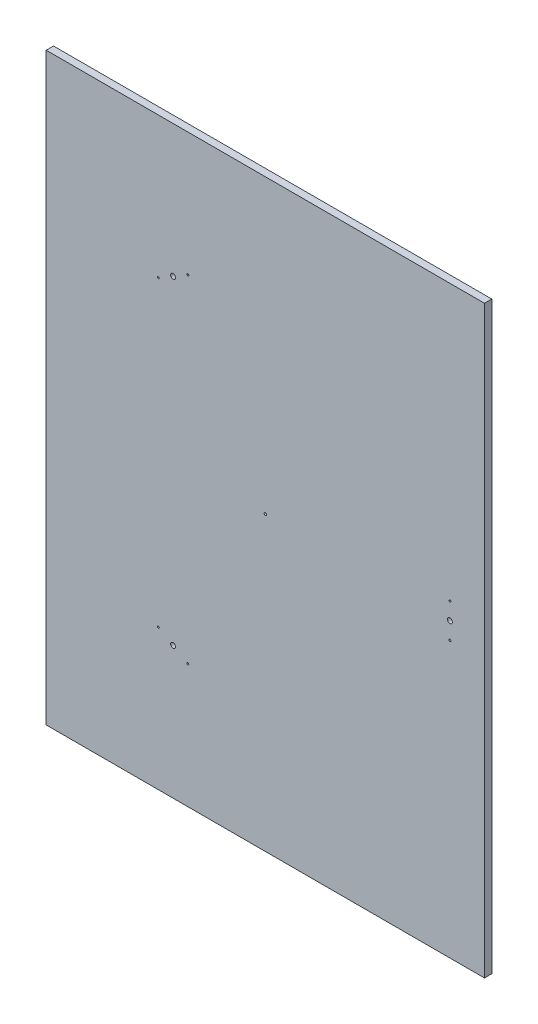
ISO-10303-21;
HEADER;
FILE_DESCRIPTION(('STEP AP214'),'2;1');
FILE_NAME('part.step','',(''),(''),'','','');
FILE_SCHEMA(('AUTOMOTIVE_DESIGN { 1 0 10303 214 1 1 1 1 }'));
ENDSEC;
DATA;
#1=APPLICATION_CONTEXT('core data for automotive mechanical design processes');
#2=APPLICATION_PROTOCOL_DEFINITION('international standard','automotive_design',2000,#1);
#3=PRODUCT_CONTEXT('',#1,'mechanical');
#4=PRODUCT('Part','Part','',(#3));
#5=PRODUCT_RELATED_PRODUCT_CATEGORY('part','',(#4));
#6=PRODUCT_DEFINITION_FORMATION('','',#4);
#7=PRODUCT_DEFINITION_CONTEXT('part definition',#1,'design');
#8=PRODUCT_DEFINITION('design','',#6,#7);
#9=PRODUCT_DEFINITION_SHAPE('','',#8);
#10=(LENGTH_UNIT() NAMED_UNIT(*) SI_UNIT(.MILLI.,.METRE.));
#11=(NAMED_UNIT(*) PLANE_ANGLE_UNIT() SI_UNIT($,.RADIAN.));
#12=(NAMED_UNIT(*) SI_UNIT($,.STERADIAN.) SOLID_ANGLE_UNIT());
#13=UNCERTAINTY_MEASURE_WITH_UNIT(LENGTH_MEASURE(1.E-05),#10,'distance_accuracy_value','');
#14=(GEOMETRIC_REPRESENTATION_CONTEXT(3) GLOBAL_UNCERTAINTY_ASSIGNED_CONTEXT((#13)) GLOBAL_UNIT_ASSIGNED_CONTEXT((#10,
#11,#12)) REPRESENTATION_CONTEXT('',''));
#15=CARTESIAN_POINT('',(0.,0.,0.));
#16=DIRECTION('',(0.,0.,1.));
#17=DIRECTION('',(1.,0.,0.));
#18=AXIS2_PLACEMENT_3D('',#15,#16,#17);
#19=CARTESIAN_POINT('',(0.,0.,15.));
#20=DIRECTION('',(0.,0.,-1.));
#21=DIRECTION('',(-1.,0.,0.));
#22=AXIS2_PLACEMENT_3D('',#19,#20,#21);
#23=PLANE('',#22);
#24=DIRECTION('',(0.,1.,0.));
#25=VECTOR('',#24,1.);
#26=CARTESIAN_POINT('',(450.,-600.,15.));
#27=LINE('',#26,#25);
#28=CARTESIAN_POINT('',(450.,-600.,15.));
#29=VERTEX_POINT('',#28);
#30=CARTESIAN_POINT('',(450.,600.,15.));
#31=VERTEX_POINT('',#30);
#32=EDGE_CURVE('E85',#29,#31,#27,.T.);
#33=ORIENTED_EDGE('',*,*,#32,.T.);
#34=DIRECTION('',(-1.,0.,0.));
#35=VECTOR('',#34,1.);
#36=CARTESIAN_POINT('',(-450.,600.,15.));
#37=LINE('',#36,#35);
#38=CARTESIAN_POINT('',(-450.,600.,15.));
#39=VERTEX_POINT('',#38);
#40=EDGE_CURVE('E80',#31,#39,#37,.T.);
#41=ORIENTED_EDGE('',*,*,#40,.T.);
#42=DIRECTION('',(0.,-1.,0.));
#43=VECTOR('',#42,1.);
#44=CARTESIAN_POINT('',(-450.,-600.,15.));
#45=LINE('',#44,#43);
#46=CARTESIAN_POINT('',(-450.,-600.,15.));
#47=VERTEX_POINT('',#46);
#48=EDGE_CURVE('E83',#39,#47,#45,.T.);
#49=ORIENTED_EDGE('',*,*,#48,.T.);
#50=DIRECTION('',(1.,0.,0.));
#51=VECTOR('',#50,1.);
#52=CARTESIAN_POINT('',(-450.,-600.,15.));
#53=LINE('',#52,#51);
#54=EDGE_CURVE('E50',#47,#29,#53,.T.);
#55=ORIENTED_EDGE('',*,*,#54,.T.);
#56=EDGE_LOOP('',(#33,#41,#49,#55));
#57=FACE_BOUND('',#56,.T.);
#58=CARTESIAN_POINT('',(379.,0.,15.));
#59=DIRECTION('',(0.,0.,1.));
#60=DIRECTION('',(1.,0.,0.));
#61=AXIS2_PLACEMENT_3D('',#58,#59,#60);
#62=CIRCLE('',#61,4.99999999999999);
#63=CARTESIAN_POINT('',(384.,0.,15.));
#64=VERTEX_POINT('',#63);
#65=EDGE_CURVE('E100',#64,#64,#62,.T.);
#66=ORIENTED_EDGE('',*,*,#65,.F.);
#67=EDGE_LOOP('',(#66));
#68=FACE_BOUND('',#67,.T.);
#69=CARTESIAN_POINT('',(379.,35.,15.));
#70=DIRECTION('',(0.,0.,1.));
#71=DIRECTION('',(1.,0.,0.));
#72=AXIS2_PLACEMENT_3D('',#69,#70,#71);
#73=CIRCLE('',#72,2.);
#74=CARTESIAN_POINT('',(381.,35.,15.));
#75=VERTEX_POINT('',#74);
#76=EDGE_CURVE('E115',#75,#75,#73,.T.);
#77=ORIENTED_EDGE('',*,*,#76,.F.);
#78=EDGE_LOOP('',(#77));
#79=FACE_BOUND('',#78,.T.);
#80=CARTESIAN_POINT('',(379.,-35.,15.));
#81=DIRECTION('',(0.,0.,1.));
#82=DIRECTION('',(1.,0.,0.));
#83=AXIS2_PLACEMENT_3D('',#80,#81,#82);
#84=CIRCLE('',#83,2.);
#85=CARTESIAN_POINT('',(381.,-35.,15.));
#86=VERTEX_POINT('',#85);
#87=EDGE_CURVE('E121',#86,#86,#84,.T.);
#88=ORIENTED_EDGE('',*,*,#87,.F.);
#89=EDGE_LOOP('',(#88));
#90=FACE_BOUND('',#89,.T.);
#91=CARTESIAN_POINT('',(0.,0.,15.));
#92=DIRECTION('',(0.,0.,1.));
#93=DIRECTION('',(1.,0.,0.));
#94=AXIS2_PLACEMENT_3D('',#91,#92,#93);
#95=CIRCLE('',#94,2.5);
#96=CARTESIAN_POINT('',(2.5,0.,15.));
#97=VERTEX_POINT('',#96);
#98=EDGE_CURVE('E127',#97,#97,#95,.T.);
#99=ORIENTED_EDGE('',*,*,#98,.F.);
#100=EDGE_LOOP('',(#99));
#101=FACE_BOUND('',#100,.T.);
#102=CARTESIAN_POINT('',(-189.500000000002,-328.223628034301,15.));
#103=DIRECTION('',(0.,0.,1.));
#104=DIRECTION('',(1.,0.,0.));
#105=AXIS2_PLACEMENT_3D('',#102,#103,#104);
#106=CIRCLE('',#105,5.);
#107=CARTESIAN_POINT('',(-184.500000000002,-328.223628034301,15.));
#108=VERTEX_POINT('',#107);
#109=EDGE_CURVE('E133',#108,#108,#106,.T.);
#110=ORIENTED_EDGE('',*,*,#109,.F.);
#111=EDGE_LOOP('',(#110));
#112=FACE_BOUND('',#111,.T.);
#113=CARTESIAN_POINT('',(-159.189110867546,-345.723628034302,15.));
#114=DIRECTION('',(0.,0.,1.));
#115=DIRECTION('',(1.,0.,0.));
#116=AXIS2_PLACEMENT_3D('',#113,#114,#115);
#117=CIRCLE('',#116,2.);
#118=CARTESIAN_POINT('',(-157.189110867546,-345.723628034302,15.));
#119=VERTEX_POINT('',#118);
#120=EDGE_CURVE('E139',#119,#119,#117,.T.);
#121=ORIENTED_EDGE('',*,*,#120,.F.);
#122=EDGE_LOOP('',(#121));
#123=FACE_BOUND('',#122,.T.);
#124=CARTESIAN_POINT('',(-219.810889132457,-310.723628034301,15.));
#125=DIRECTION('',(0.,0.,1.));
#126=DIRECTION('',(1.,0.,0.));
#127=AXIS2_PLACEMENT_3D('',#124,#125,#126);
#128=CIRCLE('',#127,2.);
#129=CARTESIAN_POINT('',(-217.810889132457,-310.723628034301,15.));
#130=VERTEX_POINT('',#129);
#131=EDGE_CURVE('E145',#130,#130,#128,.T.);
#132=ORIENTED_EDGE('',*,*,#131,.F.);
#133=EDGE_LOOP('',(#132));
#134=FACE_BOUND('',#133,.T.);
#135=CARTESIAN_POINT('',(-189.499999999997,328.223628034304,15.));
#136=DIRECTION('',(0.,0.,1.));
#137=DIRECTION('',(1.,0.,0.));
#138=AXIS2_PLACEMENT_3D('',#135,#136,#137);
#139=CIRCLE('',#138,4.99999999999997);
#140=CARTESIAN_POINT('',(-184.499999999997,328.223628034304,15.));
#141=VERTEX_POINT('',#140);
#142=EDGE_CURVE('E151',#141,#141,#139,.T.);
#143=ORIENTED_EDGE('',*,*,#142,.F.);
#144=EDGE_LOOP('',(#143));
#145=FACE_BOUND('',#144,.T.);
#146=CARTESIAN_POINT('',(-219.810889132452,310.723628034304,15.));
#147=DIRECTION('',(0.,0.,1.));
#148=DIRECTION('',(1.,0.,0.));
#149=AXIS2_PLACEMENT_3D('',#146,#147,#148);
#150=CIRCLE('',#149,2.);
#151=CARTESIAN_POINT('',(-217.810889132452,310.723628034304,15.));
#152=VERTEX_POINT('',#151);
#153=EDGE_CURVE('E157',#152,#152,#150,.T.);
#154=ORIENTED_EDGE('',*,*,#153,.F.);
#155=EDGE_LOOP('',(#154));
#156=FACE_BOUND('',#155,.T.);
#157=CARTESIAN_POINT('',(-159.189110867541,345.723628034304,15.));
#158=DIRECTION('',(0.,0.,1.));
#159=DIRECTION('',(1.,0.,0.));
#160=AXIS2_PLACEMENT_3D('',#157,#158,#159);
#161=CIRCLE('',#160,2.00000000000002);
#162=CARTESIAN_POINT('',(-157.189110867541,345.723628034304,15.));
#163=VERTEX_POINT('',#162);
#164=EDGE_CURVE('E163',#163,#163,#161,.T.);
#165=ORIENTED_EDGE('',*,*,#164,.F.);
#166=EDGE_LOOP('',(#165));
#167=FACE_BOUND('',#166,.T.);
#168=ADVANCED_FACE('F33',(#57,#68,#79,#90,#101,#112,#123,#134,#145,#156,#167),#23,.F.);
#169=CARTESIAN_POINT('',(0.,0.,0.));
#170=DIRECTION('',(0.,0.,-1.));
#171=DIRECTION('',(-1.,0.,0.));
#172=AXIS2_PLACEMENT_3D('',#169,#170,#171);
#173=PLANE('',#172);
#174=CARTESIAN_POINT('',(-219.810889132452,310.723628034304,0.));
#175=DIRECTION('',(0.,0.,1.));
#176=DIRECTION('',(1.,0.,0.));
#177=AXIS2_PLACEMENT_3D('',#174,#175,#176);
#178=CIRCLE('',#177,2.);
#179=CARTESIAN_POINT('',(-217.810889132452,310.723628034304,0.));
#180=VERTEX_POINT('',#179);
#181=EDGE_CURVE('E160',#180,#180,#178,.T.);
#182=ORIENTED_EDGE('',*,*,#181,.T.);
#183=EDGE_LOOP('',(#182));
#184=FACE_BOUND('',#183,.T.);
#185=CARTESIAN_POINT('',(-219.810889132457,-310.723628034301,0.));
#186=DIRECTION('',(0.,0.,1.));
#187=DIRECTION('',(1.,0.,0.));
#188=AXIS2_PLACEMENT_3D('',#185,#186,#187);
#189=CIRCLE('',#188,2.);
#190=CARTESIAN_POINT('',(-217.810889132457,-310.723628034301,0.));
#191=VERTEX_POINT('',#190);
#192=EDGE_CURVE('E148',#191,#191,#189,.T.);
#193=ORIENTED_EDGE('',*,*,#192,.T.);
#194=EDGE_LOOP('',(#193));
#195=FACE_BOUND('',#194,.T.);
#196=CARTESIAN_POINT('',(-189.500000000002,-328.223628034301,0.));
#197=DIRECTION('',(0.,0.,1.));
#198=DIRECTION('',(1.,0.,0.));
#199=AXIS2_PLACEMENT_3D('',#196,#197,#198);
#200=CIRCLE('',#199,5.);
#201=CARTESIAN_POINT('',(-184.500000000002,-328.223628034301,0.));
#202=VERTEX_POINT('',#201);
#203=EDGE_CURVE('E136',#202,#202,#200,.T.);
#204=ORIENTED_EDGE('',*,*,#203,.T.);
#205=EDGE_LOOP('',(#204));
#206=FACE_BOUND('',#205,.T.);
#207=CARTESIAN_POINT('',(379.,-35.,0.));
#208=DIRECTION('',(0.,0.,1.));
#209=DIRECTION('',(1.,0.,0.));
#210=AXIS2_PLACEMENT_3D('',#207,#208,#209);
#211=CIRCLE('',#210,2.);
#212=CARTESIAN_POINT('',(381.,-35.,0.));
#213=VERTEX_POINT('',#212);
#214=EDGE_CURVE('E124',#213,#213,#211,.T.);
#215=ORIENTED_EDGE('',*,*,#214,.T.);
#216=EDGE_LOOP('',(#215));
#217=FACE_BOUND('',#216,.T.);
#218=CARTESIAN_POINT('',(379.,0.,0.));
#219=DIRECTION('',(0.,0.,1.));
#220=DIRECTION('',(1.,0.,0.));
#221=AXIS2_PLACEMENT_3D('',#218,#219,#220);
#222=CIRCLE('',#221,4.99999999999999);
#223=CARTESIAN_POINT('',(384.,0.,0.));
#224=VERTEX_POINT('',#223);
#225=EDGE_CURVE('E112',#224,#224,#222,.T.);
#226=ORIENTED_EDGE('',*,*,#225,.T.);
#227=EDGE_LOOP('',(#226));
#228=FACE_BOUND('',#227,.T.);
#229=DIRECTION('',(0.,1.,0.));
#230=VECTOR('',#229,1.);
#231=CARTESIAN_POINT('',(450.,-600.,0.));
#232=LINE('',#231,#230);
#233=CARTESIAN_POINT('',(450.,-600.,0.));
#234=VERTEX_POINT('',#233);
#235=CARTESIAN_POINT('',(450.,600.,0.));
#236=VERTEX_POINT('',#235);
#237=EDGE_CURVE('E97',#234,#236,#232,.T.);
#238=ORIENTED_EDGE('',*,*,#237,.F.);
#239=DIRECTION('',(1.,0.,0.));
#240=VECTOR('',#239,1.);
#241=CARTESIAN_POINT('',(-450.,-600.,0.));
#242=LINE('',#241,#240);
#243=CARTESIAN_POINT('',(-450.,-600.,0.));
#244=VERTEX_POINT('',#243);
#245=EDGE_CURVE('E73',#244,#234,#242,.T.);
#246=ORIENTED_EDGE('',*,*,#245,.F.);
#247=DIRECTION('',(0.,-1.,0.));
#248=VECTOR('',#247,1.);
#249=CARTESIAN_POINT('',(-450.,-600.,0.));
#250=LINE('',#249,#248);
#251=CARTESIAN_POINT('',(-450.,600.,0.));
#252=VERTEX_POINT('',#251);
#253=EDGE_CURVE('E67',#252,#244,#250,.T.);
#254=ORIENTED_EDGE('',*,*,#253,.F.);
#255=DIRECTION('',(-1.,0.,0.));
#256=VECTOR('',#255,1.);
#257=CARTESIAN_POINT('',(-450.,600.,0.));
#258=LINE('',#257,#256);
#259=EDGE_CURVE('E89',#236,#252,#258,.T.);
#260=ORIENTED_EDGE('',*,*,#259,.F.);
#261=EDGE_LOOP('',(#238,#246,#254,#260));
#262=FACE_BOUND('',#261,.T.);
#263=CARTESIAN_POINT('',(379.,35.,0.));
#264=DIRECTION('',(0.,0.,1.));
#265=DIRECTION('',(1.,0.,0.));
#266=AXIS2_PLACEMENT_3D('',#263,#264,#265);
#267=CIRCLE('',#266,2.);
#268=CARTESIAN_POINT('',(381.,35.,0.));
#269=VERTEX_POINT('',#268);
#270=EDGE_CURVE('E118',#269,#269,#267,.T.);
#271=ORIENTED_EDGE('',*,*,#270,.T.);
#272=EDGE_LOOP('',(#271));
#273=FACE_BOUND('',#272,.T.);
#274=CARTESIAN_POINT('',(0.,0.,0.));
#275=DIRECTION('',(0.,0.,1.));
#276=DIRECTION('',(1.,0.,0.));
#277=AXIS2_PLACEMENT_3D('',#274,#275,#276);
#278=CIRCLE('',#277,2.5);
#279=CARTESIAN_POINT('',(2.5,0.,0.));
#280=VERTEX_POINT('',#279);
#281=EDGE_CURVE('E130',#280,#280,#278,.T.);
#282=ORIENTED_EDGE('',*,*,#281,.T.);
#283=EDGE_LOOP('',(#282));
#284=FACE_BOUND('',#283,.T.);
#285=CARTESIAN_POINT('',(-159.189110867546,-345.723628034302,0.));
#286=DIRECTION('',(0.,0.,1.));
#287=DIRECTION('',(1.,0.,0.));
#288=AXIS2_PLACEMENT_3D('',#285,#286,#287);
#289=CIRCLE('',#288,2.);
#290=CARTESIAN_POINT('',(-157.189110867546,-345.723628034302,0.));
#291=VERTEX_POINT('',#290);
#292=EDGE_CURVE('E142',#291,#291,#289,.T.);
#293=ORIENTED_EDGE('',*,*,#292,.T.);
#294=EDGE_LOOP('',(#293));
#295=FACE_BOUND('',#294,.T.);
#296=CARTESIAN_POINT('',(-189.499999999997,328.223628034304,0.));
#297=DIRECTION('',(0.,0.,1.));
#298=DIRECTION('',(1.,0.,0.));
#299=AXIS2_PLACEMENT_3D('',#296,#297,#298);
#300=CIRCLE('',#299,4.99999999999997);
#301=CARTESIAN_POINT('',(-184.499999999997,328.223628034304,0.));
#302=VERTEX_POINT('',#301);
#303=EDGE_CURVE('E154',#302,#302,#300,.T.);
#304=ORIENTED_EDGE('',*,*,#303,.T.);
#305=EDGE_LOOP('',(#304));
#306=FACE_BOUND('',#305,.T.);
#307=CARTESIAN_POINT('',(-159.189110867541,345.723628034304,0.));
#308=DIRECTION('',(0.,0.,1.));
#309=DIRECTION('',(1.,0.,0.));
#310=AXIS2_PLACEMENT_3D('',#307,#308,#309);
#311=CIRCLE('',#310,2.00000000000002);
#312=CARTESIAN_POINT('',(-157.189110867541,345.723628034304,0.));
#313=VERTEX_POINT('',#312);
#314=EDGE_CURVE('E166',#313,#313,#311,.T.);
#315=ORIENTED_EDGE('',*,*,#314,.T.);
#316=EDGE_LOOP('',(#315));
#317=FACE_BOUND('',#316,.T.);
#318=ADVANCED_FACE('F108',(#184,#195,#206,#217,#228,#262,#273,#284,#295,#306,#317),#173,.T.);
#319=CARTESIAN_POINT('',(450.,-600.,15.));
#320=DIRECTION('',(-1.,0.,0.));
#321=DIRECTION('',(0.,0.,1.));
#322=AXIS2_PLACEMENT_3D('',#319,#320,#321);
#323=PLANE('',#322);
#324=ORIENTED_EDGE('',*,*,#237,.T.);
#325=DIRECTION('',(0.,0.,-1.));
#326=VECTOR('',#325,1.);
#327=CARTESIAN_POINT('',(450.,600.,15.));
#328=LINE('',#327,#326);
#329=EDGE_CURVE('E11',#31,#236,#328,.T.);
#330=ORIENTED_EDGE('',*,*,#329,.F.);
#331=ORIENTED_EDGE('',*,*,#32,.F.);
#332=DIRECTION('',(0.,0.,-1.));
#333=VECTOR('',#332,1.);
#334=CARTESIAN_POINT('',(450.,-600.,15.));
#335=LINE('',#334,#333);
#336=EDGE_CURVE('E93',#29,#234,#335,.T.);
#337=ORIENTED_EDGE('',*,*,#336,.T.);
#338=EDGE_LOOP('',(#324,#330,#331,#337));
#339=FACE_BOUND('',#338,.T.);
#340=ADVANCED_FACE('F35',(#339),#323,.F.);
#341=CARTESIAN_POINT('',(-450.,600.,15.));
#342=DIRECTION('',(0.,-1.,0.));
#343=DIRECTION('',(0.,0.,-1.));
#344=AXIS2_PLACEMENT_3D('',#341,#342,#343);
#345=PLANE('',#344);
#346=ORIENTED_EDGE('',*,*,#259,.T.);
#347=DIRECTION('',(0.,0.,-1.));
#348=VECTOR('',#347,1.);
#349=CARTESIAN_POINT('',(-450.,600.,15.));
#350=LINE('',#349,#348);
#351=EDGE_CURVE('E42',#39,#252,#350,.T.);
#352=ORIENTED_EDGE('',*,*,#351,.F.);
#353=ORIENTED_EDGE('',*,*,#40,.F.);
#354=ORIENTED_EDGE('',*,*,#329,.T.);
#355=EDGE_LOOP('',(#346,#352,#353,#354));
#356=FACE_BOUND('',#355,.T.);
#357=ADVANCED_FACE('F88',(#356),#345,.F.);
#358=CARTESIAN_POINT('',(-450.,-600.,15.));
#359=DIRECTION('',(1.,0.,0.));
#360=DIRECTION('',(0.,0.,-1.));
#361=AXIS2_PLACEMENT_3D('',#358,#359,#360);
#362=PLANE('',#361);
#363=ORIENTED_EDGE('',*,*,#253,.T.);
#364=DIRECTION('',(0.,0.,-1.));
#365=VECTOR('',#364,1.);
#366=CARTESIAN_POINT('',(-450.,-600.,15.));
#367=LINE('',#366,#365);
#368=EDGE_CURVE('E90',#47,#244,#367,.T.);
#369=ORIENTED_EDGE('',*,*,#368,.F.);
#370=ORIENTED_EDGE('',*,*,#48,.F.);
#371=ORIENTED_EDGE('',*,*,#351,.T.);
#372=EDGE_LOOP('',(#363,#369,#370,#371));
#373=FACE_BOUND('',#372,.T.);
#374=ADVANCED_FACE('F91',(#373),#362,.F.);
#375=CARTESIAN_POINT('',(-450.,-600.,15.));
#376=DIRECTION('',(0.,1.,0.));
#377=DIRECTION('',(0.,0.,1.));
#378=AXIS2_PLACEMENT_3D('',#375,#376,#377);
#379=PLANE('',#378);
#380=ORIENTED_EDGE('',*,*,#245,.T.);
#381=ORIENTED_EDGE('',*,*,#336,.F.);
#382=ORIENTED_EDGE('',*,*,#54,.F.);
#383=ORIENTED_EDGE('',*,*,#368,.T.);
#384=EDGE_LOOP('',(#380,#381,#382,#383));
#385=FACE_BOUND('',#384,.T.);
#386=ADVANCED_FACE('F105',(#385),#379,.F.);
#387=CARTESIAN_POINT('',(379.,0.,15.));
#388=DIRECTION('',(0.,0.,-1.));
#389=DIRECTION('',(-1.,0.,0.));
#390=AXIS2_PLACEMENT_3D('',#387,#388,#389);
#391=CYLINDRICAL_SURFACE('',#390,4.99999999999999);
#392=ORIENTED_EDGE('',*,*,#65,.T.);
#393=EDGE_LOOP('',(#392));
#394=FACE_BOUND('',#393,.T.);
#395=ORIENTED_EDGE('',*,*,#225,.F.);
#396=EDGE_LOOP('',(#395));
#397=FACE_BOUND('',#396,.T.);
#398=ADVANCED_FACE('F183',(#394,#397),#391,.F.);
#399=CARTESIAN_POINT('',(379.,35.,15.));
#400=DIRECTION('',(0.,0.,-1.));
#401=DIRECTION('',(-1.,0.,0.));
#402=AXIS2_PLACEMENT_3D('',#399,#400,#401);
#403=CYLINDRICAL_SURFACE('',#402,2.);
#404=ORIENTED_EDGE('',*,*,#76,.T.);
#405=EDGE_LOOP('',(#404));
#406=FACE_BOUND('',#405,.T.);
#407=ORIENTED_EDGE('',*,*,#270,.F.);
#408=EDGE_LOOP('',(#407));
#409=FACE_BOUND('',#408,.T.);
#410=ADVANCED_FACE('F229',(#406,#409),#403,.F.);
#411=CARTESIAN_POINT('',(379.,-35.,15.));
#412=DIRECTION('',(0.,0.,-1.));
#413=DIRECTION('',(-1.,0.,0.));
#414=AXIS2_PLACEMENT_3D('',#411,#412,#413);
#415=CYLINDRICAL_SURFACE('',#414,2.);
#416=ORIENTED_EDGE('',*,*,#87,.T.);
#417=EDGE_LOOP('',(#416));
#418=FACE_BOUND('',#417,.T.);
#419=ORIENTED_EDGE('',*,*,#214,.F.);
#420=EDGE_LOOP('',(#419));
#421=FACE_BOUND('',#420,.T.);
#422=ADVANCED_FACE('F237',(#418,#421),#415,.F.);
#423=CARTESIAN_POINT('',(0.,0.,15.));
#424=DIRECTION('',(0.,0.,-1.));
#425=DIRECTION('',(-1.,0.,0.));
#426=AXIS2_PLACEMENT_3D('',#423,#424,#425);
#427=CYLINDRICAL_SURFACE('',#426,2.5);
#428=ORIENTED_EDGE('',*,*,#98,.T.);
#429=EDGE_LOOP('',(#428));
#430=FACE_BOUND('',#429,.T.);
#431=ORIENTED_EDGE('',*,*,#281,.F.);
#432=EDGE_LOOP('',(#431));
#433=FACE_BOUND('',#432,.T.);
#434=ADVANCED_FACE('F245',(#430,#433),#427,.F.);
#435=CARTESIAN_POINT('',(-189.500000000002,-328.223628034301,15.));
#436=DIRECTION('',(0.,0.,-1.));
#437=DIRECTION('',(-1.,0.,0.));
#438=AXIS2_PLACEMENT_3D('',#435,#436,#437);
#439=CYLINDRICAL_SURFACE('',#438,5.);
#440=ORIENTED_EDGE('',*,*,#109,.T.);
#441=EDGE_LOOP('',(#440));
#442=FACE_BOUND('',#441,.T.);
#443=ORIENTED_EDGE('',*,*,#203,.F.);
#444=EDGE_LOOP('',(#443));
#445=FACE_BOUND('',#444,.T.);
#446=ADVANCED_FACE('F254',(#442,#445),#439,.F.);
#447=CARTESIAN_POINT('',(-159.189110867546,-345.723628034302,15.));
#448=DIRECTION('',(0.,0.,-1.));
#449=DIRECTION('',(-1.,0.,0.));
#450=AXIS2_PLACEMENT_3D('',#447,#448,#449);
#451=CYLINDRICAL_SURFACE('',#450,2.);
#452=ORIENTED_EDGE('',*,*,#120,.T.);
#453=EDGE_LOOP('',(#452));
#454=FACE_BOUND('',#453,.T.);
#455=ORIENTED_EDGE('',*,*,#292,.F.);
#456=EDGE_LOOP('',(#455));
#457=FACE_BOUND('',#456,.T.);
#458=ADVANCED_FACE('F263',(#454,#457),#451,.F.);
#459=CARTESIAN_POINT('',(-219.810889132457,-310.723628034301,15.));
#460=DIRECTION('',(0.,0.,-1.));
#461=DIRECTION('',(-1.,0.,0.));
#462=AXIS2_PLACEMENT_3D('',#459,#460,#461);
#463=CYLINDRICAL_SURFACE('',#462,2.);
#464=ORIENTED_EDGE('',*,*,#131,.T.);
#465=EDGE_LOOP('',(#464));
#466=FACE_BOUND('',#465,.T.);
#467=ORIENTED_EDGE('',*,*,#192,.F.);
#468=EDGE_LOOP('',(#467));
#469=FACE_BOUND('',#468,.T.);
#470=ADVANCED_FACE('F272',(#466,#469),#463,.F.);
#471=CARTESIAN_POINT('',(-189.499999999997,328.223628034304,15.));
#472=DIRECTION('',(0.,0.,-1.));
#473=DIRECTION('',(-1.,0.,0.));
#474=AXIS2_PLACEMENT_3D('',#471,#472,#473);
#475=CYLINDRICAL_SURFACE('',#474,4.99999999999997);
#476=ORIENTED_EDGE('',*,*,#142,.T.);
#477=EDGE_LOOP('',(#476));
#478=FACE_BOUND('',#477,.T.);
#479=ORIENTED_EDGE('',*,*,#303,.F.);
#480=EDGE_LOOP('',(#479));
#481=FACE_BOUND('',#480,.T.);
#482=ADVANCED_FACE('F281',(#478,#481),#475,.F.);
#483=CARTESIAN_POINT('',(-219.810889132452,310.723628034304,15.));
#484=DIRECTION('',(0.,0.,-1.));
#485=DIRECTION('',(-1.,0.,0.));
#486=AXIS2_PLACEMENT_3D('',#483,#484,#485);
#487=CYLINDRICAL_SURFACE('',#486,2.);
#488=ORIENTED_EDGE('',*,*,#153,.T.);
#489=EDGE_LOOP('',(#488));
#490=FACE_BOUND('',#489,.T.);
#491=ORIENTED_EDGE('',*,*,#181,.F.);
#492=EDGE_LOOP('',(#491));
#493=FACE_BOUND('',#492,.T.);
#494=ADVANCED_FACE('F290',(#490,#493),#487,.F.);
#495=CARTESIAN_POINT('',(-159.189110867541,345.723628034304,15.));
#496=DIRECTION('',(0.,0.,-1.));
#497=DIRECTION('',(-1.,0.,0.));
#498=AXIS2_PLACEMENT_3D('',#495,#496,#497);
#499=CYLINDRICAL_SURFACE('',#498,2.00000000000002);
#500=ORIENTED_EDGE('',*,*,#164,.T.);
#501=EDGE_LOOP('',(#500));
#502=FACE_BOUND('',#501,.T.);
#503=ORIENTED_EDGE('',*,*,#314,.F.);
#504=EDGE_LOOP('',(#503));
#505=FACE_BOUND('',#504,.T.);
#506=ADVANCED_FACE('F172',(#502,#505),#499,.F.);
#507=CLOSED_SHELL('',(#168,#318,#340,#357,#374,#386,#398,#410,#422,#434,#446,#458,#470,#482,
#494,#506));
#508=MANIFOLD_SOLID_BREP('B2',#507);
#509=ADVANCED_BREP_SHAPE_REPRESENTATION('',(#18,#508),#14);
#510=SHAPE_DEFINITION_REPRESENTATION(#9,#509);
ENDSEC;
END-ISO-10303-21;
